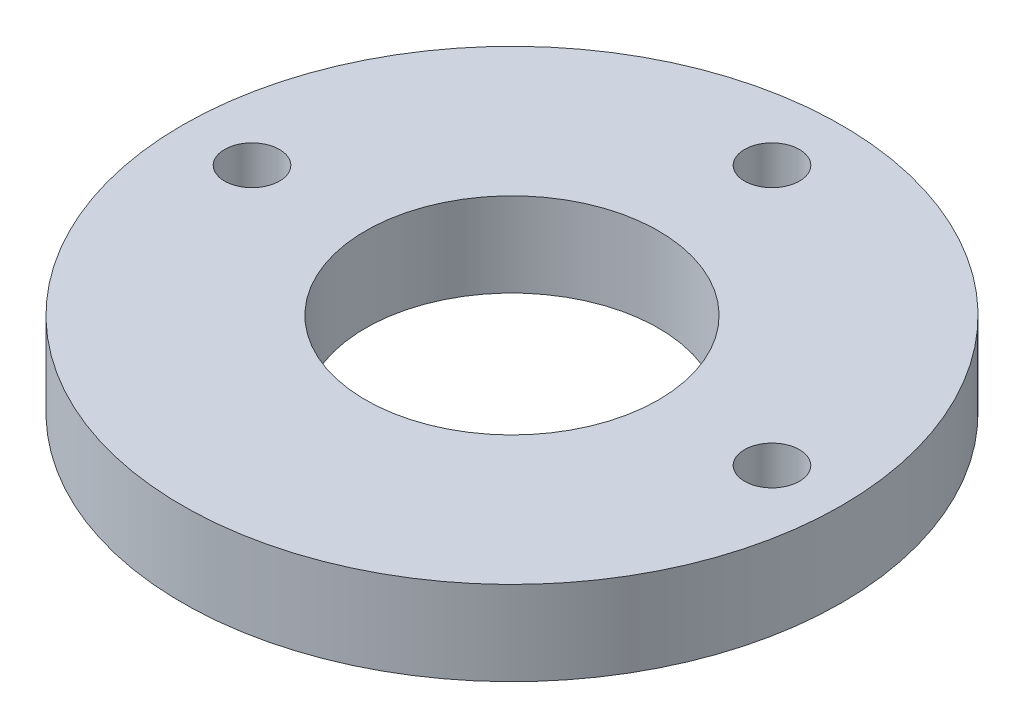
ISO-10303-21;
HEADER;
FILE_DESCRIPTION(('STEP AP214'),'2;1');
FILE_NAME('part.step','',(''),(''),'','','');
FILE_SCHEMA(('AUTOMOTIVE_DESIGN { 1 0 10303 214 1 1 1 1 }'));
ENDSEC;
DATA;
#1=APPLICATION_CONTEXT('core data for automotive mechanical design processes');
#2=APPLICATION_PROTOCOL_DEFINITION('international standard','automotive_design',2000,#1);
#3=PRODUCT_CONTEXT('',#1,'mechanical');
#4=PRODUCT('Part','Part','',(#3));
#5=PRODUCT_RELATED_PRODUCT_CATEGORY('part','',(#4));
#6=PRODUCT_DEFINITION_FORMATION('','',#4);
#7=PRODUCT_DEFINITION_CONTEXT('part definition',#1,'design');
#8=PRODUCT_DEFINITION('design','',#6,#7);
#9=PRODUCT_DEFINITION_SHAPE('','',#8);
#10=(LENGTH_UNIT() NAMED_UNIT(*) SI_UNIT(.MILLI.,.METRE.));
#11=(NAMED_UNIT(*) PLANE_ANGLE_UNIT() SI_UNIT($,.RADIAN.));
#12=(NAMED_UNIT(*) SI_UNIT($,.STERADIAN.) SOLID_ANGLE_UNIT());
#13=UNCERTAINTY_MEASURE_WITH_UNIT(LENGTH_MEASURE(1.E-05),#10,'distance_accuracy_value','');
#14=(GEOMETRIC_REPRESENTATION_CONTEXT(3) GLOBAL_UNCERTAINTY_ASSIGNED_CONTEXT((#13)) GLOBAL_UNIT_ASSIGNED_CONTEXT((#10,
#11,#12)) REPRESENTATION_CONTEXT('',''));
#15=CARTESIAN_POINT('',(0.,0.,0.));
#16=DIRECTION('',(0.,0.,1.));
#17=DIRECTION('',(1.,0.,0.));
#18=AXIS2_PLACEMENT_3D('',#15,#16,#17);
#19=CARTESIAN_POINT('',(-27.,-11.5,0.));
#20=DIRECTION('',(0.,1.,0.));
#21=DIRECTION('',(1.,0.,0.));
#22=AXIS2_PLACEMENT_3D('',#19,#20,#21);
#23=PLANE('',#22);
#24=CARTESIAN_POINT('',(-27.,-11.5,0.));
#25=DIRECTION('',(0.,1.,0.));
#26=DIRECTION('',(-1.,0.,0.));
#27=AXIS2_PLACEMENT_3D('',#24,#25,#26);
#28=CIRCLE('',#27,8.);
#29=CARTESIAN_POINT('',(-19.,-11.5,0.));
#30=VERTEX_POINT('',#29);
#31=EDGE_CURVE('E97',#30,#30,#28,.T.);
#32=ORIENTED_EDGE('',*,*,#31,.T.);
#33=EDGE_LOOP('',(#32));
#34=FACE_BOUND('',#33,.T.);
#35=CARTESIAN_POINT('',(-41.2,-11.5,0.));
#36=DIRECTION('',(0.,1.,0.));
#37=DIRECTION('',(1.,0.,0.));
#38=AXIS2_PLACEMENT_3D('',#35,#36,#37);
#39=CIRCLE('',#38,1.5);
#40=CARTESIAN_POINT('',(-42.7,-11.5,0.));
#41=VERTEX_POINT('',#40);
#42=EDGE_CURVE('E90',#41,#41,#39,.T.);
#43=ORIENTED_EDGE('',*,*,#42,.T.);
#44=EDGE_LOOP('',(#43));
#45=FACE_BOUND('',#44,.T.);
#46=CARTESIAN_POINT('',(-27.,-11.5,-14.2));
#47=DIRECTION('',(0.,1.,0.));
#48=DIRECTION('',(1.,0.,0.));
#49=AXIS2_PLACEMENT_3D('',#46,#47,#48);
#50=CIRCLE('',#49,1.5);
#51=CARTESIAN_POINT('',(-28.5,-11.5,-14.2));
#52=VERTEX_POINT('',#51);
#53=EDGE_CURVE('E107',#52,#52,#50,.T.);
#54=ORIENTED_EDGE('',*,*,#53,.T.);
#55=EDGE_LOOP('',(#54));
#56=FACE_BOUND('',#55,.T.);
#57=CARTESIAN_POINT('',(-12.8,-11.5,0.));
#58=DIRECTION('',(0.,1.,0.));
#59=DIRECTION('',(1.,0.,0.));
#60=AXIS2_PLACEMENT_3D('',#57,#58,#59);
#61=CIRCLE('',#60,1.5);
#62=CARTESIAN_POINT('',(-14.3,-11.5,0.));
#63=VERTEX_POINT('',#62);
#64=EDGE_CURVE('E109',#63,#63,#61,.T.);
#65=ORIENTED_EDGE('',*,*,#64,.T.);
#66=EDGE_LOOP('',(#65));
#67=FACE_BOUND('',#66,.T.);
#68=CARTESIAN_POINT('',(-27.,-11.5,0.));
#69=DIRECTION('',(0.,-1.,0.));
#70=DIRECTION('',(1.,0.,0.));
#71=AXIS2_PLACEMENT_3D('',#68,#69,#70);
#72=CIRCLE('',#71,18.);
#73=CARTESIAN_POINT('',(-45.,-11.5,0.));
#74=VERTEX_POINT('',#73);
#75=EDGE_CURVE('E100',#74,#74,#72,.T.);
#76=ORIENTED_EDGE('',*,*,#75,.T.);
#77=EDGE_LOOP('',(#76));
#78=FACE_BOUND('',#77,.T.);
#79=ADVANCED_FACE('F14',(#34,#45,#56,#67,#78),#23,.F.);
#80=CARTESIAN_POINT('',(-27.,-6.9,0.));
#81=DIRECTION('',(0.,1.,0.));
#82=DIRECTION('',(1.,0.,0.));
#83=AXIS2_PLACEMENT_3D('',#80,#81,#82);
#84=PLANE('',#83);
#85=CARTESIAN_POINT('',(-27.,-6.9,0.));
#86=DIRECTION('',(0.,-1.,0.));
#87=DIRECTION('',(-1.,0.,0.));
#88=AXIS2_PLACEMENT_3D('',#85,#86,#87);
#89=CIRCLE('',#88,8.);
#90=CARTESIAN_POINT('',(-19.,-6.9,0.));
#91=VERTEX_POINT('',#90);
#92=EDGE_CURVE('E18',#91,#91,#89,.T.);
#93=ORIENTED_EDGE('',*,*,#92,.T.);
#94=EDGE_LOOP('',(#93));
#95=FACE_BOUND('',#94,.T.);
#96=CARTESIAN_POINT('',(-41.2,-6.9,0.));
#97=DIRECTION('',(0.,-1.,0.));
#98=DIRECTION('',(1.,0.,0.));
#99=AXIS2_PLACEMENT_3D('',#96,#97,#98);
#100=CIRCLE('',#99,1.5);
#101=CARTESIAN_POINT('',(-42.7,-6.9,0.));
#102=VERTEX_POINT('',#101);
#103=EDGE_CURVE('E76',#102,#102,#100,.T.);
#104=ORIENTED_EDGE('',*,*,#103,.T.);
#105=EDGE_LOOP('',(#104));
#106=FACE_BOUND('',#105,.T.);
#107=CARTESIAN_POINT('',(-27.,-6.9,-14.2));
#108=DIRECTION('',(0.,-1.,0.));
#109=DIRECTION('',(1.,0.,0.));
#110=AXIS2_PLACEMENT_3D('',#107,#108,#109);
#111=CIRCLE('',#110,1.5);
#112=CARTESIAN_POINT('',(-28.5,-6.9,-14.2));
#113=VERTEX_POINT('',#112);
#114=EDGE_CURVE('E96',#113,#113,#111,.T.);
#115=ORIENTED_EDGE('',*,*,#114,.T.);
#116=EDGE_LOOP('',(#115));
#117=FACE_BOUND('',#116,.T.);
#118=CARTESIAN_POINT('',(-12.8,-6.9,0.));
#119=DIRECTION('',(0.,-1.,0.));
#120=DIRECTION('',(1.,0.,0.));
#121=AXIS2_PLACEMENT_3D('',#118,#119,#120);
#122=CIRCLE('',#121,1.5);
#123=CARTESIAN_POINT('',(-14.3,-6.9,0.));
#124=VERTEX_POINT('',#123);
#125=EDGE_CURVE('E104',#124,#124,#122,.T.);
#126=ORIENTED_EDGE('',*,*,#125,.T.);
#127=EDGE_LOOP('',(#126));
#128=FACE_BOUND('',#127,.T.);
#129=CARTESIAN_POINT('',(-27.,-6.9,0.));
#130=DIRECTION('',(0.,1.,0.));
#131=DIRECTION('',(1.,0.,0.));
#132=AXIS2_PLACEMENT_3D('',#129,#130,#131);
#133=CIRCLE('',#132,18.);
#134=CARTESIAN_POINT('',(-45.,-6.9,0.));
#135=VERTEX_POINT('',#134);
#136=EDGE_CURVE('E9',#135,#135,#133,.T.);
#137=ORIENTED_EDGE('',*,*,#136,.T.);
#138=EDGE_LOOP('',(#137));
#139=FACE_BOUND('',#138,.T.);
#140=ADVANCED_FACE('F77',(#95,#106,#117,#128,#139),#84,.T.);
#141=CARTESIAN_POINT('',(-27.,-6.9,0.));
#142=DIRECTION('',(0.,-1.,0.));
#143=DIRECTION('',(1.,0.,0.));
#144=AXIS2_PLACEMENT_3D('',#141,#142,#143);
#145=CYLINDRICAL_SURFACE('',#144,18.);
#146=ORIENTED_EDGE('',*,*,#75,.F.);
#147=DIRECTION('',(0.,1.,0.));
#148=VECTOR('',#147,1.);
#149=CARTESIAN_POINT('',(-45.,-6.9,0.));
#150=LINE('',#149,#148);
#151=EDGE_CURVE('E24',#74,#135,#150,.T.);
#152=ORIENTED_EDGE('',*,*,#151,.T.);
#153=ORIENTED_EDGE('',*,*,#136,.F.);
#154=ORIENTED_EDGE('',*,*,#151,.F.);
#155=EDGE_LOOP('',(#146,#152,#153,#154));
#156=FACE_BOUND('',#155,.T.);
#157=ADVANCED_FACE('F16',(#156),#145,.T.);
#158=CARTESIAN_POINT('',(-27.,-6.9,0.));
#159=DIRECTION('',(0.,-1.,0.));
#160=DIRECTION('',(-1.,0.,0.));
#161=AXIS2_PLACEMENT_3D('',#158,#159,#160);
#162=CYLINDRICAL_SURFACE('',#161,8.);
#163=ORIENTED_EDGE('',*,*,#92,.F.);
#164=DIRECTION('',(0.,-1.,0.));
#165=VECTOR('',#164,1.);
#166=CARTESIAN_POINT('',(-19.,-6.9,0.));
#167=LINE('',#166,#165);
#168=EDGE_CURVE('E89',#91,#30,#167,.T.);
#169=ORIENTED_EDGE('',*,*,#168,.T.);
#170=ORIENTED_EDGE('',*,*,#31,.F.);
#171=ORIENTED_EDGE('',*,*,#168,.F.);
#172=EDGE_LOOP('',(#163,#169,#170,#171));
#173=FACE_BOUND('',#172,.T.);
#174=ADVANCED_FACE('F149',(#173),#162,.F.);
#175=CARTESIAN_POINT('',(-41.2,-11.5,0.));
#176=DIRECTION('',(0.,1.,0.));
#177=DIRECTION('',(1.,0.,0.));
#178=AXIS2_PLACEMENT_3D('',#175,#176,#177);
#179=CYLINDRICAL_SURFACE('',#178,1.5);
#180=ORIENTED_EDGE('',*,*,#42,.F.);
#181=DIRECTION('',(0.,1.,0.));
#182=VECTOR('',#181,1.);
#183=CARTESIAN_POINT('',(-42.7,-11.5,0.));
#184=LINE('',#183,#182);
#185=EDGE_CURVE('E82',#41,#102,#184,.T.);
#186=ORIENTED_EDGE('',*,*,#185,.T.);
#187=ORIENTED_EDGE('',*,*,#103,.F.);
#188=ORIENTED_EDGE('',*,*,#185,.F.);
#189=EDGE_LOOP('',(#180,#186,#187,#188));
#190=FACE_BOUND('',#189,.T.);
#191=ADVANCED_FACE('F154',(#190),#179,.F.);
#192=CARTESIAN_POINT('',(-27.,-11.5,-14.2));
#193=DIRECTION('',(0.,1.,0.));
#194=DIRECTION('',(1.,0.,0.));
#195=AXIS2_PLACEMENT_3D('',#192,#193,#194);
#196=CYLINDRICAL_SURFACE('',#195,1.5);
#197=ORIENTED_EDGE('',*,*,#53,.F.);
#198=DIRECTION('',(0.,1.,0.));
#199=VECTOR('',#198,1.);
#200=CARTESIAN_POINT('',(-28.5,-11.5,-14.2));
#201=LINE('',#200,#199);
#202=EDGE_CURVE('E113',#52,#113,#201,.T.);
#203=ORIENTED_EDGE('',*,*,#202,.T.);
#204=ORIENTED_EDGE('',*,*,#114,.F.);
#205=ORIENTED_EDGE('',*,*,#202,.F.);
#206=EDGE_LOOP('',(#197,#203,#204,#205));
#207=FACE_BOUND('',#206,.T.);
#208=ADVANCED_FACE('F134',(#207),#196,.F.);
#209=CARTESIAN_POINT('',(-12.8,-11.5,0.));
#210=DIRECTION('',(0.,1.,0.));
#211=DIRECTION('',(1.,0.,0.));
#212=AXIS2_PLACEMENT_3D('',#209,#210,#211);
#213=CYLINDRICAL_SURFACE('',#212,1.5);
#214=ORIENTED_EDGE('',*,*,#64,.F.);
#215=DIRECTION('',(0.,1.,0.));
#216=VECTOR('',#215,1.);
#217=CARTESIAN_POINT('',(-14.3,-11.5,0.));
#218=LINE('',#217,#216);
#219=EDGE_CURVE('E108',#63,#124,#218,.T.);
#220=ORIENTED_EDGE('',*,*,#219,.T.);
#221=ORIENTED_EDGE('',*,*,#125,.F.);
#222=ORIENTED_EDGE('',*,*,#219,.F.);
#223=EDGE_LOOP('',(#214,#220,#221,#222));
#224=FACE_BOUND('',#223,.T.);
#225=ADVANCED_FACE('F143',(#224),#213,.F.);
#226=CLOSED_SHELL('',(#79,#140,#157,#174,#191,#208,#225));
#227=MANIFOLD_SOLID_BREP('B1',#226);
#228=ADVANCED_BREP_SHAPE_REPRESENTATION('',(#18,#227),#14);
#229=SHAPE_DEFINITION_REPRESENTATION(#9,#228);
ENDSEC;
END-ISO-10303-21;
